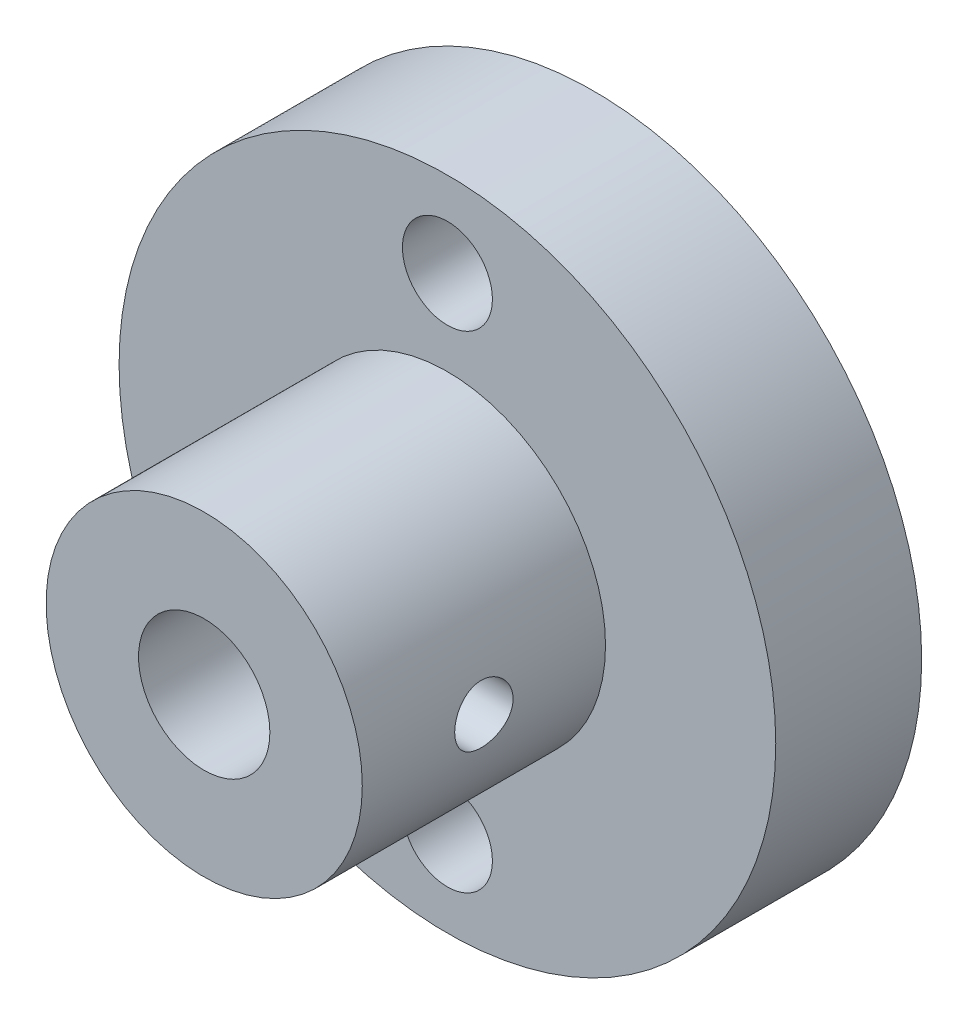
ISO-10303-21;
HEADER;
FILE_DESCRIPTION(('STEP AP214'),'2;1');
FILE_NAME('part.step','',(''),(''),'','','');
FILE_SCHEMA(('AUTOMOTIVE_DESIGN { 1 0 10303 214 1 1 1 1 }'));
ENDSEC;
DATA;
#1=APPLICATION_CONTEXT('core data for automotive mechanical design processes');
#2=APPLICATION_PROTOCOL_DEFINITION('international standard','automotive_design',2000,#1);
#3=PRODUCT_CONTEXT('',#1,'mechanical');
#4=PRODUCT('Part','Part','',(#3));
#5=PRODUCT_RELATED_PRODUCT_CATEGORY('part','',(#4));
#6=PRODUCT_DEFINITION_FORMATION('','',#4);
#7=PRODUCT_DEFINITION_CONTEXT('part definition',#1,'design');
#8=PRODUCT_DEFINITION('design','',#6,#7);
#9=PRODUCT_DEFINITION_SHAPE('','',#8);
#10=(LENGTH_UNIT() NAMED_UNIT(*) SI_UNIT(.MILLI.,.METRE.));
#11=(NAMED_UNIT(*) PLANE_ANGLE_UNIT() SI_UNIT($,.RADIAN.));
#12=(NAMED_UNIT(*) SI_UNIT($,.STERADIAN.) SOLID_ANGLE_UNIT());
#13=UNCERTAINTY_MEASURE_WITH_UNIT(LENGTH_MEASURE(1.E-05),#10,'distance_accuracy_value','');
#14=(GEOMETRIC_REPRESENTATION_CONTEXT(3) GLOBAL_UNCERTAINTY_ASSIGNED_CONTEXT((#13)) GLOBAL_UNIT_ASSIGNED_CONTEXT((#10,
#11,#12)) REPRESENTATION_CONTEXT('',''));
#15=CARTESIAN_POINT('',(0.,0.,0.));
#16=DIRECTION('',(0.,0.,1.));
#17=DIRECTION('',(1.,0.,0.));
#18=AXIS2_PLACEMENT_3D('',#15,#16,#17);
#19=CARTESIAN_POINT('',(25.,0.,11.));
#20=DIRECTION('',(-1.,0.,0.));
#21=DIRECTION('',(0.,0.,1.));
#22=AXIS2_PLACEMENT_3D('',#19,#20,#21);
#23=CYLINDRICAL_SURFACE('',#22,1.2);
#24=CARTESIAN_POINT('',(6.5,0.,12.2));
#25=CARTESIAN_POINT('',(6.49999879727572,-0.0667962993626081,12.1999974278829));
#26=CARTESIAN_POINT('',(6.49895972178335,-0.133626281673587,12.1944039721681));
#27=CARTESIAN_POINT('',(6.49491478174011,-0.265404300030401,12.172191600608));
#28=CARTESIAN_POINT('',(6.49190723570874,-0.330350677512255,12.1555632585209));
#29=CARTESIAN_POINT('',(6.48426191804226,-0.456436519782737,12.1118065638594));
#30=CARTESIAN_POINT('',(6.47962559903149,-0.517579319792999,12.0846875652248));
#31=CARTESIAN_POINT('',(6.46922952137734,-0.63444110969497,12.0207456276995));
#32=CARTESIAN_POINT('',(6.46346985907829,-0.690160564109868,11.9839235209079));
#33=CARTESIAN_POINT('',(6.45138834939994,-0.795247744205699,11.9011660344249));
#34=CARTESIAN_POINT('',(6.44506127279023,-0.844543292388614,11.8551397561373));
#35=CARTESIAN_POINT('',(6.43259702053078,-0.934759066401608,11.7554760006652));
#36=CARTESIAN_POINT('',(6.42645985829691,-0.975678701684754,11.7018379872634));
#37=CARTESIAN_POINT('',(6.41501951319584,-1.04827972317034,11.5879653111489));
#38=CARTESIAN_POINT('',(6.40972307507926,-1.07988798202191,11.5276832879546));
#39=CARTESIAN_POINT('',(6.40063738902812,-1.13250094978906,11.4025506689439));
#40=CARTESIAN_POINT('',(6.39684801526784,-1.15350654396689,11.3377004550609));
#41=CARTESIAN_POINT('',(6.39125806003697,-1.18408687284635,11.2060436035491));
#42=CARTESIAN_POINT('',(6.38943562620813,-1.19378730462821,11.1392671080334));
#43=CARTESIAN_POINT('',(6.38791998048299,-1.20187204389847,11.0050113933146));
#44=CARTESIAN_POINT('',(6.38822658354097,-1.20025733484479,10.9375322356926));
#45=CARTESIAN_POINT('',(6.39091446543458,-1.18585961873334,10.8046953870345));
#46=CARTESIAN_POINT('',(6.39326923845306,-1.17321929073711,10.7393216161376));
#47=CARTESIAN_POINT('',(6.39974652439446,-1.13735373323502,10.6116388619997));
#48=CARTESIAN_POINT('',(6.40386911035101,-1.11412806641468,10.5493300054981));
#49=CARTESIAN_POINT('',(6.41344535336497,-1.05761084900825,10.4291269281805));
#50=CARTESIAN_POINT('',(6.41890662438299,-1.0242614500129,10.3712605382117));
#51=CARTESIAN_POINT('',(6.43053982016241,-0.948484370023446,10.2618912881752));
#52=CARTESIAN_POINT('',(6.43671181488758,-0.906055794920213,10.2103890556326));
#53=CARTESIAN_POINT('',(6.44918666593044,-0.812554310960555,10.1143854911831));
#54=CARTESIAN_POINT('',(6.45549008145401,-0.761359307961523,10.0700030583735));
#55=CARTESIAN_POINT('',(6.46743086297198,-0.652187389345437,9.9904388129452));
#56=CARTESIAN_POINT('',(6.47306822266922,-0.594210409619175,9.95525708730987));
#57=CARTESIAN_POINT('',(6.48305257458405,-0.472998043002824,9.89507639819467));
#58=CARTESIAN_POINT('',(6.48739803241448,-0.409756516582691,9.87008953010376));
#59=CARTESIAN_POINT('',(6.49429705012122,-0.279875838888337,9.83112661435116));
#60=CARTESIAN_POINT('',(6.49685079444502,-0.213237038103507,9.8171494332818));
#61=CARTESIAN_POINT('',(6.49985338930874,-0.0794766430718829,9.80076752083491));
#62=CARTESIAN_POINT('',(6.50033187707818,-0.0123756497053712,9.79819983464421));
#63=CARTESIAN_POINT('',(6.49921181273706,0.121296981962713,9.8042730761626));
#64=CARTESIAN_POINT('',(6.49761335943468,0.187868645294989,9.8129134706596));
#65=CARTESIAN_POINT('',(6.49253745576473,0.318077984755796,9.84102211191283));
#66=CARTESIAN_POINT('',(6.48907427500552,0.381734009693139,9.86040816155233));
#67=CARTESIAN_POINT('',(6.4806556240529,0.504892375398316,9.9093690573418));
#68=CARTESIAN_POINT('',(6.47570005497306,0.564394440600633,9.93894457867032));
#69=CARTESIAN_POINT('',(6.4647724074758,0.678253095830679,10.0078073610227));
#70=CARTESIAN_POINT('',(6.45879008348503,0.732548265605505,10.0471945163265));
#71=CARTESIAN_POINT('',(6.44649953986676,0.833816870545852,10.1344270136108));
#72=CARTESIAN_POINT('',(6.44019129083715,0.880789643607566,10.1822731196305));
#73=CARTESIAN_POINT('',(6.42786191143313,0.966697085412809,10.2858021083737));
#74=CARTESIAN_POINT('',(6.42184551244879,1.00552070246097,10.3415777973493));
#75=CARTESIAN_POINT('',(6.41087523291019,1.07324774919417,10.4589549357169));
#76=CARTESIAN_POINT('',(6.40592131362856,1.10215154047974,10.5205561726499));
#77=CARTESIAN_POINT('',(6.39767379439307,1.14905975241548,10.6475497087302));
#78=CARTESIAN_POINT('',(6.39437235713613,1.16711570494917,10.7129224406376));
#79=CARTESIAN_POINT('',(6.38978543443045,1.19197513111159,10.8458401771607));
#80=CARTESIAN_POINT('',(6.38849972926177,1.19877983115992,10.9133849441999));
#81=CARTESIAN_POINT('',(6.3881007482456,1.20090353537778,11.0476175572827));
#82=CARTESIAN_POINT('',(6.38895435075601,1.19639765292492,11.1143025975303));
#83=CARTESIAN_POINT('',(6.39266448585662,1.17641079397786,11.2459474188607));
#84=CARTESIAN_POINT('',(6.39552100733921,1.16092987834811,11.310907209509));
#85=CARTESIAN_POINT('',(6.40290136886896,1.11950532017773,11.4371671962626));
#86=CARTESIAN_POINT('',(6.40742227523992,1.09358007946632,11.4984736122883));
#87=CARTESIAN_POINT('',(6.41762418955728,1.032021760182,11.6158947376739));
#88=CARTESIAN_POINT('',(6.42330527598439,0.996388024820644,11.6720090954421));
#89=CARTESIAN_POINT('',(6.43529057182139,0.915813071798076,11.7783315161889));
#90=CARTESIAN_POINT('',(6.44160263227606,0.870744203302652,11.8284419719686));
#91=CARTESIAN_POINT('',(6.45407937835197,0.772845002820405,11.9204475390134));
#92=CARTESIAN_POINT('',(6.46024402977463,0.720012889705214,11.9623407598269));
#93=CARTESIAN_POINT('',(6.47179409996219,0.607537484977904,12.0370617405115));
#94=CARTESIAN_POINT('',(6.47717228318667,0.547839004017674,12.0698075747291));
#95=CARTESIAN_POINT('',(6.48647285935735,0.42370854944922,12.124752828699));
#96=CARTESIAN_POINT('',(6.49039663100581,0.3592811283988,12.1469622420194));
#97=CARTESIAN_POINT('',(6.49553807584249,0.245545866371185,12.1756491928211));
#98=CARTESIAN_POINT('',(6.49720192234607,0.196906528350574,12.1847652844566));
#99=CARTESIAN_POINT('',(6.49943331626516,0.0988509306569767,12.1969415668264));
#100=CARTESIAN_POINT('',(6.50000089011371,0.0494346897454305,12.2000019035757));
#101=CARTESIAN_POINT('',(6.5,0.,12.2));
#102=B_SPLINE_CURVE_WITH_KNOTS('',3,(#24,#25,#26,#27,#28,#29,#30,#31,#32,#33,#34,#35,#36,#37,
#38,#39,#40,#41,#42,#43,#44,#45,#46,#47,#48,#49,#50,#51,#52,#53,#54,#55,#56,#57,#58,#59,#60,#61,
#62,#63,#64,#65,#66,#67,#68,#69,#70,#71,#72,#73,#74,#75,#76,#77,#78,#79,#80,#81,#82,#83,#84,#85,
#86,#87,#88,#89,#90,#91,#92,#93,#94,#95,#96,#97,#98,#99,#100,#101),.UNSPECIFIED.,.T.,.F.,(4,2,2,
2,2,2,2,2,2,2,2,2,2,2,2,2,2,2,2,2,2,2,2,2,2,2,2,2,2,2,2,2,2,2,2,2,2,2,4),(0.,0.200208125257265,
0.400587493204053,0.600788604213543,0.800972552376601,1.00324088953467,1.20552348279051,
1.40935476877731,1.61316903319364,1.81469487992138,2.01620321120369,2.21514193787252,
2.41408888408644,2.61419475105378,2.81432033334393,3.01750151628566,3.2206846200298,
3.42410808829514,3.6275106121083,3.8279985269071,4.02847690406412,4.22744250539259,
4.42642129319003,4.62751523490318,4.8286273493452,5.03232388047527,5.23601298560803,
5.43872666786995,5.64141825228765,5.84099112816951,6.04056289728494,6.23978456857919,
6.43901972074741,6.64114822168659,6.84332316977221,7.04725467103852,7.25099235904022,
7.39916621446434,7.54733649711547),.UNSPECIFIED.);
#103=CARTESIAN_POINT('',(6.5,0.,12.2));
#104=VERTEX_POINT('',#103);
#105=EDGE_CURVE('E83',#104,#104,#102,.T.);
#106=ORIENTED_EDGE('',*,*,#105,.T.);
#107=EDGE_LOOP('',(#106));
#108=FACE_BOUND('',#107,.T.);
#109=CARTESIAN_POINT('',(2.7,0.,12.2));
#110=CARTESIAN_POINT('',(2.69999413362057,0.0639065591023064,12.1999923831793));
#111=CARTESIAN_POINT('',(2.69770564197874,0.127893036523807,12.1948654918272));
#112=CARTESIAN_POINT('',(2.68877100210596,0.25403557600969,12.1745501771965));
#113=CARTESIAN_POINT('',(2.68211438349655,0.316186864128076,12.1593375776189));
#114=CARTESIAN_POINT('',(2.66515409854901,0.436621100359764,12.1195393890298));
#115=CARTESIAN_POINT('',(2.65486345340692,0.494916988807218,12.0949872409192));
#116=CARTESIAN_POINT('',(2.63161770990452,0.606498876298807,12.0373549198206));
#117=CARTESIAN_POINT('',(2.61866321902908,0.659786013548984,12.0042766907538));
#118=CARTESIAN_POINT('',(2.59055992340384,0.762887990999931,11.9285990703182));
#119=CARTESIAN_POINT('',(2.57533308413914,0.81238898179779,11.8856014072593));
#120=CARTESIAN_POINT('',(2.54471118380751,0.903753990005821,11.7921510489153));
#121=CARTESIAN_POINT('',(2.52931602821855,0.945613455081426,11.7416939419488));
#122=CARTESIAN_POINT('',(2.49909628261832,1.02290764342971,11.6312367647985));
#123=CARTESIAN_POINT('',(2.48435595827186,1.05783186961991,11.5708539108751));
#124=CARTESIAN_POINT('',(2.45837526696494,1.11688834822608,11.4443268523912));
#125=CARTESIAN_POINT('',(2.44713285796118,1.14102690079927,11.3781860382369));
#126=CARTESIAN_POINT('',(2.43027734905002,1.17648691470213,11.2456277716151));
#127=CARTESIAN_POINT('',(2.42439919523154,1.18841590189109,11.1794079593235));
#128=CARTESIAN_POINT('',(2.41818878362474,1.20100696979013,11.0456661379365));
#129=CARTESIAN_POINT('',(2.4178528219447,1.20167657524167,10.9781450287237));
#130=CARTESIAN_POINT('',(2.42254366026567,1.19218298581507,10.8501827308142));
#131=CARTESIAN_POINT('',(2.4270931542614,1.18298402341183,10.7896487784958));
#132=CARTESIAN_POINT('',(2.44022617227002,1.15564860756994,10.6710948650284));
#133=CARTESIAN_POINT('',(2.44881060282323,1.13751014562483,10.6130754720334));
#134=CARTESIAN_POINT('',(2.46924514284841,1.09245124275327,10.4996398233602));
#135=CARTESIAN_POINT('',(2.48116423077023,1.06534281441842,10.4443112329153));
#136=CARTESIAN_POINT('',(2.50691446994658,1.00324870493604,10.3387544513155));
#137=CARTESIAN_POINT('',(2.52074642529426,0.968259707202767,10.2885284205557));
#138=CARTESIAN_POINT('',(2.55039983349783,0.887404851023686,10.1894518391137));
#139=CARTESIAN_POINT('',(2.56628383219961,0.840811456550148,10.1412119129495));
#140=CARTESIAN_POINT('',(2.59712939767392,0.740062927274395,10.0530095338656));
#141=CARTESIAN_POINT('',(2.61209068461612,0.68590551463452,10.0130495834241));
#142=CARTESIAN_POINT('',(2.63995469383987,0.569491655107122,9.94147206336678));
#143=CARTESIAN_POINT('',(2.6527835515846,0.507043222559378,9.91013579408398));
#144=CARTESIAN_POINT('',(2.67435348404006,0.377044453719878,9.85863383005269));
#145=CARTESIAN_POINT('',(2.68309713525878,0.309497364424834,9.83846109306621));
#146=CARTESIAN_POINT('',(2.69500955063424,0.176292321296718,9.81121287038837));
#147=CARTESIAN_POINT('',(2.69852547661778,0.110832697825019,9.80331998164941));
#148=CARTESIAN_POINT('',(2.70072002319156,-0.020566223274589,9.7983781261587));
#149=CARTESIAN_POINT('',(2.69940028683998,-0.0865053503783305,9.80132547611901));
#150=CARTESIAN_POINT('',(2.69229177327389,-0.212944450043092,9.8174261436085));
#151=CARTESIAN_POINT('',(2.6867671065459,-0.273537850639587,9.8299765355117));
#152=CARTESIAN_POINT('',(2.67210325388452,-0.391675243775097,9.86405478746183));
#153=CARTESIAN_POINT('',(2.66296362867872,-0.449218864755503,9.88558373855752));
#154=CARTESIAN_POINT('',(2.64157426404399,-0.561662431159979,9.93769332944624));
#155=CARTESIAN_POINT('',(2.62923639136989,-0.616423892001831,9.96853540826862));
#156=CARTESIAN_POINT('',(2.60272873830794,-0.720191567250078,10.0381108556107));
#157=CARTESIAN_POINT('',(2.58855816108654,-0.769195260470478,10.0768476608872));
#158=CARTESIAN_POINT('',(2.5584767589195,-0.864220327521456,10.1647500678792));
#159=CARTESIAN_POINT('',(2.54251772459568,-0.909683032438224,10.2145045624883));
#160=CARTESIAN_POINT('',(2.51162480970985,-0.991801453598339,10.3211332041893));
#161=CARTESIAN_POINT('',(2.49669129392246,-1.02845404757698,10.3780098645164));
#162=CARTESIAN_POINT('',(2.46928674093927,-1.09264543882237,10.4990745846855));
#163=CARTESIAN_POINT('',(2.45688177642213,-1.11994996636762,10.5634029898212));
#164=CARTESIAN_POINT('',(2.4367650168031,-1.16307895210515,10.6964760891825));
#165=CARTESIAN_POINT('',(2.42904862954254,-1.1789146462074,10.7652163890263));
#166=CARTESIAN_POINT('',(2.41995032134622,-1.19747128693734,10.8988889457178));
#167=CARTESIAN_POINT('',(2.41808692940897,-1.20119006801553,10.9636501271561));
#168=CARTESIAN_POINT('',(2.41959773517966,-1.19814464927904,11.0928557618811));
#169=CARTESIAN_POINT('',(2.42297081605554,-1.19138268479251,11.157300279765));
#170=CARTESIAN_POINT('',(2.43410978875393,-1.16844135931616,11.2800151564985));
#171=CARTESIAN_POINT('',(2.44159919634577,-1.15285303217351,11.3384237119317));
#172=CARTESIAN_POINT('',(2.45987368091073,-1.11332516751525,11.4517891509191));
#173=CARTESIAN_POINT('',(2.4706597105559,-1.08938321564955,11.5067450311624));
#174=CARTESIAN_POINT('',(2.49516633461298,-1.03207265496533,11.6155025669727));
#175=CARTESIAN_POINT('',(2.50903068581858,-0.998198297609607,11.6690045975486));
#176=CARTESIAN_POINT('',(2.53778753442993,-0.922641583993335,11.7698748803223));
#177=CARTESIAN_POINT('',(2.55268045962436,-0.880955966494673,11.8172405565419));
#178=CARTESIAN_POINT('',(2.58337941872399,-0.78664877081698,11.9087734791821));
#179=CARTESIAN_POINT('',(2.59915136690634,-0.733389540278599,11.9522984992548));
#180=CARTESIAN_POINT('',(2.62855906078181,-0.619771086799431,12.0298610087285));
#181=CARTESIAN_POINT('',(2.64219382936338,-0.559408638242745,12.0638941639895));
#182=CARTESIAN_POINT('',(2.66567555365819,-0.433830067434941,12.1209347672237));
#183=CARTESIAN_POINT('',(2.67556359629795,-0.368676545242857,12.1440625356446));
#184=CARTESIAN_POINT('',(2.69059030099947,-0.234972811511182,12.178782185816));
#185=CARTESIAN_POINT('',(2.69574344748542,-0.166433639459938,12.1904092575191));
#186=CARTESIAN_POINT('',(2.69941490841779,-0.0650184194495728,12.1986821692355));
#187=CARTESIAN_POINT('',(2.70000298517181,-0.032519556731023,12.2000038759031));
#188=CARTESIAN_POINT('',(2.7,0.,12.2));
#189=B_SPLINE_CURVE_WITH_KNOTS('',3,(#109,#110,#111,#112,#113,#114,#115,#116,#117,#118,#119,
#120,#121,#122,#123,#124,#125,#126,#127,#128,#129,#130,#131,#132,#133,#134,#135,#136,#137,#138,
#139,#140,#141,#142,#143,#144,#145,#146,#147,#148,#149,#150,#151,#152,#153,#154,#155,#156,#157,
#158,#159,#160,#161,#162,#163,#164,#165,#166,#167,#168,#169,#170,#171,#172,#173,#174,#175,#176,
#177,#178,#179,#180,#181,#182,#183,#184,#185,#186,#187,#188),.UNSPECIFIED.,.T.,.F.,(4,2,2,2,2,2,
2,2,2,2,2,2,2,2,2,2,2,2,2,2,2,2,2,2,2,2,2,2,2,2,2,2,2,2,2,2,2,2,2,4),(0.,0.191618254692132,
0.383697503423909,0.57509537585916,0.766449648689667,0.96752346516017,1.16871668045946,
1.38152637924487,1.59421160802032,1.7957068529561,1.99706743153409,2.18040510018399,
2.36378397951647,2.55127911192394,2.73885330073873,2.94470008049905,3.15060898340504,
3.3626003754159,3.57445788501979,3.77149687786056,3.96846892713029,4.15399671722493,
4.33954705869644,4.53088617326196,4.72230876076459,4.92915910001196,5.13608263838593,
5.34786609388025,5.55944178537991,5.753084399156,5.94668571861527,6.12863978970841,
6.31064649247104,6.50431618226569,6.69806691096097,6.9087661101249,7.11956136104833,
7.32797307084532,7.53574508917101,7.63325214934906),.UNSPECIFIED.);
#190=CARTESIAN_POINT('',(2.7,0.,12.2));
#191=VERTEX_POINT('',#190);
#192=EDGE_CURVE('E56',#191,#191,#189,.T.);
#193=ORIENTED_EDGE('',*,*,#192,.T.);
#194=EDGE_LOOP('',(#193));
#195=FACE_BOUND('',#194,.T.);
#196=ADVANCED_FACE('F31',(#108,#195),#23,.F.);
#197=CARTESIAN_POINT('',(-6.5,0.,12.2));
#198=CARTESIAN_POINT('',(-6.49999879727572,0.0667962993626081,12.1999974278829));
#199=CARTESIAN_POINT('',(-6.49895972178335,0.133626281673587,12.1944039721681));
#200=CARTESIAN_POINT('',(-6.49491478174011,0.265404300030401,12.172191600608));
#201=CARTESIAN_POINT('',(-6.49190723570874,0.330350677512255,12.1555632585209));
#202=CARTESIAN_POINT('',(-6.48426191804226,0.456436519782737,12.1118065638594));
#203=CARTESIAN_POINT('',(-6.47962559903149,0.517579319792999,12.0846875652248));
#204=CARTESIAN_POINT('',(-6.46922952137734,0.63444110969497,12.0207456276995));
#205=CARTESIAN_POINT('',(-6.46346985907829,0.690160564109868,11.9839235209079));
#206=CARTESIAN_POINT('',(-6.45138834939994,0.795247744205699,11.9011660344249));
#207=CARTESIAN_POINT('',(-6.44506127279023,0.844543292388614,11.8551397561373));
#208=CARTESIAN_POINT('',(-6.43259702053078,0.934759066401608,11.7554760006652));
#209=CARTESIAN_POINT('',(-6.42645985829691,0.975678701684754,11.7018379872634));
#210=CARTESIAN_POINT('',(-6.41501951319584,1.04827972317034,11.5879653111489));
#211=CARTESIAN_POINT('',(-6.40972307507926,1.07988798202191,11.5276832879546));
#212=CARTESIAN_POINT('',(-6.40063738902812,1.13250094978906,11.4025506689439));
#213=CARTESIAN_POINT('',(-6.39684801526784,1.15350654396689,11.3377004550609));
#214=CARTESIAN_POINT('',(-6.39125806003697,1.18408687284635,11.2060436035491));
#215=CARTESIAN_POINT('',(-6.38943562620813,1.19378730462821,11.1392671080334));
#216=CARTESIAN_POINT('',(-6.38791998048299,1.20187204389847,11.0050113933146));
#217=CARTESIAN_POINT('',(-6.38822658354097,1.20025733484479,10.9375322356926));
#218=CARTESIAN_POINT('',(-6.39091446543458,1.18585961873334,10.8046953870345));
#219=CARTESIAN_POINT('',(-6.39326923845306,1.17321929073711,10.7393216161376));
#220=CARTESIAN_POINT('',(-6.39974652439446,1.13735373323502,10.6116388619997));
#221=CARTESIAN_POINT('',(-6.40386911035101,1.11412806641468,10.5493300054981));
#222=CARTESIAN_POINT('',(-6.41344535336497,1.05761084900825,10.4291269281805));
#223=CARTESIAN_POINT('',(-6.41890662438299,1.0242614500129,10.3712605382117));
#224=CARTESIAN_POINT('',(-6.43053982016241,0.948484370023446,10.2618912881752));
#225=CARTESIAN_POINT('',(-6.43671181488758,0.906055794920213,10.2103890556326));
#226=CARTESIAN_POINT('',(-6.44918666593044,0.812554310960555,10.1143854911831));
#227=CARTESIAN_POINT('',(-6.45549008145401,0.761359307961523,10.0700030583735));
#228=CARTESIAN_POINT('',(-6.46743086297198,0.652187389345437,9.9904388129452));
#229=CARTESIAN_POINT('',(-6.47306822266922,0.594210409619175,9.95525708730987));
#230=CARTESIAN_POINT('',(-6.48305257458405,0.472998043002824,9.89507639819467));
#231=CARTESIAN_POINT('',(-6.48739803241448,0.409756516582691,9.87008953010376));
#232=CARTESIAN_POINT('',(-6.49429705012122,0.279875838888337,9.83112661435116));
#233=CARTESIAN_POINT('',(-6.49685079444502,0.213237038103507,9.8171494332818));
#234=CARTESIAN_POINT('',(-6.49985338930874,0.0794766430718829,9.80076752083491));
#235=CARTESIAN_POINT('',(-6.50033187707818,0.0123756497053712,9.79819983464421));
#236=CARTESIAN_POINT('',(-6.49921181273706,-0.121296981962713,9.8042730761626));
#237=CARTESIAN_POINT('',(-6.49761335943468,-0.187868645294989,9.8129134706596));
#238=CARTESIAN_POINT('',(-6.49253745576473,-0.318077984755796,9.84102211191283));
#239=CARTESIAN_POINT('',(-6.48907427500552,-0.381734009693139,9.86040816155233));
#240=CARTESIAN_POINT('',(-6.4806556240529,-0.504892375398316,9.9093690573418));
#241=CARTESIAN_POINT('',(-6.47570005497306,-0.564394440600633,9.93894457867032));
#242=CARTESIAN_POINT('',(-6.4647724074758,-0.678253095830679,10.0078073610227));
#243=CARTESIAN_POINT('',(-6.45879008348503,-0.732548265605505,10.0471945163265));
#244=CARTESIAN_POINT('',(-6.44649953986676,-0.833816870545852,10.1344270136108));
#245=CARTESIAN_POINT('',(-6.44019129083715,-0.880789643607566,10.1822731196305));
#246=CARTESIAN_POINT('',(-6.42786191143313,-0.966697085412809,10.2858021083737));
#247=CARTESIAN_POINT('',(-6.42184551244879,-1.00552070246097,10.3415777973493));
#248=CARTESIAN_POINT('',(-6.41087523291019,-1.07324774919417,10.4589549357169));
#249=CARTESIAN_POINT('',(-6.40592131362856,-1.10215154047974,10.5205561726499));
#250=CARTESIAN_POINT('',(-6.39767379439307,-1.14905975241548,10.6475497087302));
#251=CARTESIAN_POINT('',(-6.39437235713613,-1.16711570494917,10.7129224406376));
#252=CARTESIAN_POINT('',(-6.38978543443045,-1.19197513111159,10.8458401771607));
#253=CARTESIAN_POINT('',(-6.38849972926177,-1.19877983115992,10.9133849441999));
#254=CARTESIAN_POINT('',(-6.3881007482456,-1.20090353537778,11.0476175572827));
#255=CARTESIAN_POINT('',(-6.38895435075601,-1.19639765292492,11.1143025975303));
#256=CARTESIAN_POINT('',(-6.39266448585662,-1.17641079397786,11.2459474188607));
#257=CARTESIAN_POINT('',(-6.39552100733921,-1.16092987834811,11.310907209509));
#258=CARTESIAN_POINT('',(-6.40290136886896,-1.11950532017773,11.4371671962626));
#259=CARTESIAN_POINT('',(-6.40742227523992,-1.09358007946632,11.4984736122883));
#260=CARTESIAN_POINT('',(-6.41762418955728,-1.032021760182,11.6158947376739));
#261=CARTESIAN_POINT('',(-6.42330527598439,-0.996388024820644,11.6720090954421));
#262=CARTESIAN_POINT('',(-6.43529057182139,-0.915813071798076,11.7783315161889));
#263=CARTESIAN_POINT('',(-6.44160263227606,-0.870744203302652,11.8284419719686));
#264=CARTESIAN_POINT('',(-6.45407937835197,-0.772845002820405,11.9204475390134));
#265=CARTESIAN_POINT('',(-6.46024402977463,-0.720012889705214,11.9623407598269));
#266=CARTESIAN_POINT('',(-6.47179409996219,-0.607537484977904,12.0370617405115));
#267=CARTESIAN_POINT('',(-6.47717228318667,-0.547839004017674,12.0698075747291));
#268=CARTESIAN_POINT('',(-6.48647285935735,-0.42370854944922,12.124752828699));
#269=CARTESIAN_POINT('',(-6.49039663100581,-0.3592811283988,12.1469622420194));
#270=CARTESIAN_POINT('',(-6.49553807584249,-0.245545866371185,12.1756491928211));
#271=CARTESIAN_POINT('',(-6.49720192234607,-0.196906528350574,12.1847652844566));
#272=CARTESIAN_POINT('',(-6.49943331626516,-0.0988509306569767,12.1969415668264));
#273=CARTESIAN_POINT('',(-6.50000089011371,-0.0494346897454305,12.2000019035757));
#274=CARTESIAN_POINT('',(-6.5,0.,12.2));
#275=B_SPLINE_CURVE_WITH_KNOTS('',3,(#197,#198,#199,#200,#201,#202,#203,#204,#205,#206,#207,
#208,#209,#210,#211,#212,#213,#214,#215,#216,#217,#218,#219,#220,#221,#222,#223,#224,#225,#226,
#227,#228,#229,#230,#231,#232,#233,#234,#235,#236,#237,#238,#239,#240,#241,#242,#243,#244,#245,
#246,#247,#248,#249,#250,#251,#252,#253,#254,#255,#256,#257,#258,#259,#260,#261,#262,#263,#264,
#265,#266,#267,#268,#269,#270,#271,#272,#273,#274),.UNSPECIFIED.,.T.,.F.,(4,2,2,2,2,2,2,2,2,2,2,
2,2,2,2,2,2,2,2,2,2,2,2,2,2,2,2,2,2,2,2,2,2,2,2,2,2,2,4),(0.,0.200208125257265,
0.400587493204053,0.600788604213543,0.800972552376601,1.00324088953467,1.20552348279051,
1.40935476877731,1.61316903319364,1.81469487992138,2.01620321120369,2.21514193787252,
2.41408888408644,2.61419475105378,2.81432033334393,3.01750151628566,3.2206846200298,
3.42410808829514,3.6275106121083,3.8279985269071,4.02847690406412,4.22744250539259,
4.42642129319003,4.62751523490318,4.8286273493452,5.03232388047527,5.23601298560803,
5.43872666786995,5.64141825228765,5.84099112816951,6.04056289728494,6.23978456857919,
6.43901972074741,6.64114822168659,6.84332316977221,7.04725467103852,7.25099235904022,
7.39916621446434,7.54733649711547),.UNSPECIFIED.);
#276=CARTESIAN_POINT('',(-6.5,0.,12.2));
#277=VERTEX_POINT('',#276);
#278=EDGE_CURVE('E89',#277,#277,#275,.T.);
#279=ORIENTED_EDGE('',*,*,#278,.T.);
#280=EDGE_LOOP('',(#279));
#281=FACE_BOUND('',#280,.T.);
#282=CARTESIAN_POINT('',(-2.7,0.,12.2));
#283=CARTESIAN_POINT('',(-2.69999413362057,-0.0639065591023064,12.1999923831793));
#284=CARTESIAN_POINT('',(-2.69770564197874,-0.127893036523807,12.1948654918272));
#285=CARTESIAN_POINT('',(-2.68877100210596,-0.25403557600969,12.1745501771965));
#286=CARTESIAN_POINT('',(-2.68211438349655,-0.316186864128076,12.1593375776189));
#287=CARTESIAN_POINT('',(-2.66515409854901,-0.436621100359764,12.1195393890298));
#288=CARTESIAN_POINT('',(-2.65486345340692,-0.494916988807218,12.0949872409192));
#289=CARTESIAN_POINT('',(-2.63161770990452,-0.606498876298807,12.0373549198206));
#290=CARTESIAN_POINT('',(-2.61866321902908,-0.659786013548984,12.0042766907538));
#291=CARTESIAN_POINT('',(-2.59055992340384,-0.762887990999931,11.9285990703182));
#292=CARTESIAN_POINT('',(-2.57533308413914,-0.81238898179779,11.8856014072593));
#293=CARTESIAN_POINT('',(-2.54471118380751,-0.903753990005821,11.7921510489153));
#294=CARTESIAN_POINT('',(-2.52931602821855,-0.945613455081426,11.7416939419488));
#295=CARTESIAN_POINT('',(-2.49909628261832,-1.02290764342971,11.6312367647985));
#296=CARTESIAN_POINT('',(-2.48435595827186,-1.05783186961991,11.5708539108751));
#297=CARTESIAN_POINT('',(-2.45837526696494,-1.11688834822608,11.4443268523912));
#298=CARTESIAN_POINT('',(-2.44713285796118,-1.14102690079927,11.3781860382369));
#299=CARTESIAN_POINT('',(-2.43027734905002,-1.17648691470213,11.2456277716151));
#300=CARTESIAN_POINT('',(-2.42439919523154,-1.18841590189109,11.1794079593235));
#301=CARTESIAN_POINT('',(-2.41818878362474,-1.20100696979013,11.0456661379365));
#302=CARTESIAN_POINT('',(-2.4178528219447,-1.20167657524167,10.9781450287237));
#303=CARTESIAN_POINT('',(-2.42254366026567,-1.19218298581507,10.8501827308142));
#304=CARTESIAN_POINT('',(-2.4270931542614,-1.18298402341183,10.7896487784958));
#305=CARTESIAN_POINT('',(-2.44022617227002,-1.15564860756994,10.6710948650284));
#306=CARTESIAN_POINT('',(-2.44881060282323,-1.13751014562483,10.6130754720334));
#307=CARTESIAN_POINT('',(-2.46924514284841,-1.09245124275327,10.4996398233602));
#308=CARTESIAN_POINT('',(-2.48116423077023,-1.06534281441842,10.4443112329153));
#309=CARTESIAN_POINT('',(-2.50691446994658,-1.00324870493604,10.3387544513155));
#310=CARTESIAN_POINT('',(-2.52074642529426,-0.968259707202767,10.2885284205557));
#311=CARTESIAN_POINT('',(-2.55039983349783,-0.887404851023686,10.1894518391137));
#312=CARTESIAN_POINT('',(-2.56628383219961,-0.840811456550148,10.1412119129495));
#313=CARTESIAN_POINT('',(-2.59712939767392,-0.740062927274395,10.0530095338656));
#314=CARTESIAN_POINT('',(-2.61209068461612,-0.68590551463452,10.0130495834241));
#315=CARTESIAN_POINT('',(-2.63995469383987,-0.569491655107122,9.94147206336678));
#316=CARTESIAN_POINT('',(-2.6527835515846,-0.507043222559378,9.91013579408398));
#317=CARTESIAN_POINT('',(-2.67435348404006,-0.377044453719878,9.85863383005269));
#318=CARTESIAN_POINT('',(-2.68309713525878,-0.309497364424834,9.83846109306621));
#319=CARTESIAN_POINT('',(-2.69500955063424,-0.176292321296718,9.81121287038837));
#320=CARTESIAN_POINT('',(-2.69852547661778,-0.110832697825019,9.80331998164941));
#321=CARTESIAN_POINT('',(-2.70072002319156,0.020566223274589,9.7983781261587));
#322=CARTESIAN_POINT('',(-2.69940028683998,0.0865053503783305,9.80132547611901));
#323=CARTESIAN_POINT('',(-2.69229177327389,0.212944450043092,9.8174261436085));
#324=CARTESIAN_POINT('',(-2.6867671065459,0.273537850639587,9.8299765355117));
#325=CARTESIAN_POINT('',(-2.67210325388452,0.391675243775097,9.86405478746183));
#326=CARTESIAN_POINT('',(-2.66296362867872,0.449218864755503,9.88558373855752));
#327=CARTESIAN_POINT('',(-2.64157426404399,0.561662431159979,9.93769332944624));
#328=CARTESIAN_POINT('',(-2.62923639136989,0.616423892001831,9.96853540826862));
#329=CARTESIAN_POINT('',(-2.60272873830794,0.720191567250078,10.0381108556107));
#330=CARTESIAN_POINT('',(-2.58855816108654,0.769195260470478,10.0768476608872));
#331=CARTESIAN_POINT('',(-2.5584767589195,0.864220327521456,10.1647500678792));
#332=CARTESIAN_POINT('',(-2.54251772459568,0.909683032438224,10.2145045624883));
#333=CARTESIAN_POINT('',(-2.51162480970985,0.991801453598339,10.3211332041893));
#334=CARTESIAN_POINT('',(-2.49669129392246,1.02845404757698,10.3780098645164));
#335=CARTESIAN_POINT('',(-2.46928674093927,1.09264543882237,10.4990745846855));
#336=CARTESIAN_POINT('',(-2.45688177642213,1.11994996636762,10.5634029898212));
#337=CARTESIAN_POINT('',(-2.4367650168031,1.16307895210515,10.6964760891825));
#338=CARTESIAN_POINT('',(-2.42904862954254,1.1789146462074,10.7652163890263));
#339=CARTESIAN_POINT('',(-2.41995032134622,1.19747128693734,10.8988889457178));
#340=CARTESIAN_POINT('',(-2.41808692940897,1.20119006801553,10.9636501271561));
#341=CARTESIAN_POINT('',(-2.41959773517966,1.19814464927904,11.0928557618811));
#342=CARTESIAN_POINT('',(-2.42297081605554,1.19138268479251,11.157300279765));
#343=CARTESIAN_POINT('',(-2.43410978875393,1.16844135931616,11.2800151564985));
#344=CARTESIAN_POINT('',(-2.44159919634577,1.15285303217351,11.3384237119317));
#345=CARTESIAN_POINT('',(-2.45987368091073,1.11332516751525,11.4517891509191));
#346=CARTESIAN_POINT('',(-2.4706597105559,1.08938321564955,11.5067450311624));
#347=CARTESIAN_POINT('',(-2.49516633461298,1.03207265496533,11.6155025669727));
#348=CARTESIAN_POINT('',(-2.50903068581858,0.998198297609607,11.6690045975486));
#349=CARTESIAN_POINT('',(-2.53778753442993,0.922641583993335,11.7698748803223));
#350=CARTESIAN_POINT('',(-2.55268045962436,0.880955966494673,11.8172405565419));
#351=CARTESIAN_POINT('',(-2.58337941872399,0.78664877081698,11.9087734791821));
#352=CARTESIAN_POINT('',(-2.59915136690634,0.733389540278599,11.9522984992548));
#353=CARTESIAN_POINT('',(-2.62855906078181,0.619771086799431,12.0298610087285));
#354=CARTESIAN_POINT('',(-2.64219382936338,0.559408638242745,12.0638941639895));
#355=CARTESIAN_POINT('',(-2.66567555365819,0.433830067434941,12.1209347672237));
#356=CARTESIAN_POINT('',(-2.67556359629795,0.368676545242857,12.1440625356446));
#357=CARTESIAN_POINT('',(-2.69059030099947,0.234972811511182,12.178782185816));
#358=CARTESIAN_POINT('',(-2.69574344748542,0.166433639459938,12.1904092575191));
#359=CARTESIAN_POINT('',(-2.69941490841779,0.0650184194495728,12.1986821692355));
#360=CARTESIAN_POINT('',(-2.70000298517181,0.032519556731023,12.2000038759031));
#361=CARTESIAN_POINT('',(-2.7,0.,12.2));
#362=B_SPLINE_CURVE_WITH_KNOTS('',3,(#282,#283,#284,#285,#286,#287,#288,#289,#290,#291,#292,
#293,#294,#295,#296,#297,#298,#299,#300,#301,#302,#303,#304,#305,#306,#307,#308,#309,#310,#311,
#312,#313,#314,#315,#316,#317,#318,#319,#320,#321,#322,#323,#324,#325,#326,#327,#328,#329,#330,
#331,#332,#333,#334,#335,#336,#337,#338,#339,#340,#341,#342,#343,#344,#345,#346,#347,#348,#349,
#350,#351,#352,#353,#354,#355,#356,#357,#358,#359,#360,#361),.UNSPECIFIED.,.T.,.F.,(4,2,2,2,2,2,
2,2,2,2,2,2,2,2,2,2,2,2,2,2,2,2,2,2,2,2,2,2,2,2,2,2,2,2,2,2,2,2,2,4),(0.,0.191618254692132,
0.383697503423909,0.57509537585916,0.766449648689667,0.96752346516017,1.16871668045946,
1.38152637924487,1.59421160802032,1.7957068529561,1.99706743153409,2.18040510018399,
2.36378397951647,2.55127911192394,2.73885330073873,2.94470008049905,3.15060898340504,
3.3626003754159,3.57445788501979,3.77149687786056,3.96846892713029,4.15399671722493,
4.33954705869644,4.53088617326196,4.72230876076459,4.92915910001196,5.13608263838593,
5.34786609388025,5.55944178537991,5.753084399156,5.94668571861527,6.12863978970841,
6.31064649247104,6.50431618226569,6.69806691096097,6.9087661101249,7.11956136104833,
7.32797307084532,7.53574508917101,7.63325214934906),.UNSPECIFIED.);
#363=CARTESIAN_POINT('',(-2.7,0.,12.2));
#364=VERTEX_POINT('',#363);
#365=EDGE_CURVE('E50',#364,#364,#362,.T.);
#366=ORIENTED_EDGE('',*,*,#365,.T.);
#367=EDGE_LOOP('',(#366));
#368=FACE_BOUND('',#367,.T.);
#369=ADVANCED_FACE('F96',(#281,#368),#23,.F.);
#370=CARTESIAN_POINT('',(0.,0.,16.));
#371=DIRECTION('',(0.,0.,-1.));
#372=DIRECTION('',(-1.,0.,0.));
#373=AXIS2_PLACEMENT_3D('',#370,#371,#372);
#374=CYLINDRICAL_SURFACE('',#373,6.5);
#375=CARTESIAN_POINT('',(0.,0.,16.));
#376=DIRECTION('',(0.,0.,1.));
#377=DIRECTION('',(1.,0.,0.));
#378=AXIS2_PLACEMENT_3D('',#375,#376,#377);
#379=CIRCLE('',#378,6.5);
#380=CARTESIAN_POINT('',(6.5,0.,16.));
#381=VERTEX_POINT('',#380);
#382=EDGE_CURVE('E44',#381,#381,#379,.T.);
#383=ORIENTED_EDGE('',*,*,#382,.F.);
#384=EDGE_LOOP('',(#383));
#385=FACE_BOUND('',#384,.T.);
#386=CARTESIAN_POINT('',(0.,0.,6.));
#387=DIRECTION('',(0.,0.,1.));
#388=DIRECTION('',(1.,0.,0.));
#389=AXIS2_PLACEMENT_3D('',#386,#387,#388);
#390=CIRCLE('',#389,6.5);
#391=CARTESIAN_POINT('',(6.5,0.,6.));
#392=VERTEX_POINT('',#391);
#393=EDGE_CURVE('E47',#392,#392,#390,.T.);
#394=ORIENTED_EDGE('',*,*,#393,.T.);
#395=EDGE_LOOP('',(#394));
#396=FACE_BOUND('',#395,.T.);
#397=ORIENTED_EDGE('',*,*,#105,.F.);
#398=EDGE_LOOP('',(#397));
#399=FACE_BOUND('',#398,.T.);
#400=ORIENTED_EDGE('',*,*,#278,.F.);
#401=EDGE_LOOP('',(#400));
#402=FACE_BOUND('',#401,.T.);
#403=ADVANCED_FACE('F92',(#385,#396,#399,#402),#374,.T.);
#404=CARTESIAN_POINT('',(0.,0.,6.));
#405=DIRECTION('',(0.,0.,-1.));
#406=DIRECTION('',(-1.,0.,0.));
#407=AXIS2_PLACEMENT_3D('',#404,#405,#406);
#408=CYLINDRICAL_SURFACE('',#407,13.5);
#409=CARTESIAN_POINT('',(0.,0.,6.));
#410=DIRECTION('',(0.,0.,1.));
#411=DIRECTION('',(1.,0.,0.));
#412=AXIS2_PLACEMENT_3D('',#409,#410,#411);
#413=CIRCLE('',#412,13.5);
#414=CARTESIAN_POINT('',(13.5,0.,6.));
#415=VERTEX_POINT('',#414);
#416=EDGE_CURVE('E10',#415,#415,#413,.T.);
#417=ORIENTED_EDGE('',*,*,#416,.F.);
#418=EDGE_LOOP('',(#417));
#419=FACE_BOUND('',#418,.T.);
#420=CARTESIAN_POINT('',(0.,0.,0.));
#421=DIRECTION('',(0.,0.,1.));
#422=DIRECTION('',(1.,0.,0.));
#423=AXIS2_PLACEMENT_3D('',#420,#421,#422);
#424=CIRCLE('',#423,13.5);
#425=CARTESIAN_POINT('',(13.5,0.,0.));
#426=VERTEX_POINT('',#425);
#427=EDGE_CURVE('E39',#426,#426,#424,.T.);
#428=ORIENTED_EDGE('',*,*,#427,.T.);
#429=EDGE_LOOP('',(#428));
#430=FACE_BOUND('',#429,.T.);
#431=ADVANCED_FACE('F33',(#419,#430),#408,.T.);
#432=CARTESIAN_POINT('',(0.,0.,6.));
#433=DIRECTION('',(0.,0.,1.));
#434=DIRECTION('',(1.,0.,0.));
#435=AXIS2_PLACEMENT_3D('',#432,#433,#434);
#436=PLANE('',#435);
#437=CARTESIAN_POINT('',(0.,-10.,6.));
#438=DIRECTION('',(0.,0.,-1.));
#439=DIRECTION('',(1.,0.,0.));
#440=AXIS2_PLACEMENT_3D('',#437,#438,#439);
#441=CIRCLE('',#440,1.85);
#442=CARTESIAN_POINT('',(1.85,-10.,6.));
#443=VERTEX_POINT('',#442);
#444=EDGE_CURVE('E196',#443,#443,#441,.T.);
#445=ORIENTED_EDGE('',*,*,#444,.T.);
#446=EDGE_LOOP('',(#445));
#447=FACE_BOUND('',#446,.T.);
#448=CARTESIAN_POINT('',(0.,10.,6.));
#449=DIRECTION('',(0.,0.,1.));
#450=DIRECTION('',(1.,0.,0.));
#451=AXIS2_PLACEMENT_3D('',#448,#449,#450);
#452=CIRCLE('',#451,1.85);
#453=CARTESIAN_POINT('',(1.85,10.,6.));
#454=VERTEX_POINT('',#453);
#455=EDGE_CURVE('E76',#454,#454,#452,.T.);
#456=ORIENTED_EDGE('',*,*,#455,.F.);
#457=EDGE_LOOP('',(#456));
#458=FACE_BOUND('',#457,.T.);
#459=ORIENTED_EDGE('',*,*,#393,.F.);
#460=EDGE_LOOP('',(#459));
#461=FACE_BOUND('',#460,.T.);
#462=ORIENTED_EDGE('',*,*,#416,.T.);
#463=EDGE_LOOP('',(#462));
#464=FACE_BOUND('',#463,.T.);
#465=ADVANCED_FACE('F98',(#447,#458,#461,#464),#436,.T.);
#466=CARTESIAN_POINT('',(0.,0.,0.));
#467=DIRECTION('',(0.,0.,1.));
#468=DIRECTION('',(1.,0.,0.));
#469=AXIS2_PLACEMENT_3D('',#466,#467,#468);
#470=PLANE('',#469);
#471=CARTESIAN_POINT('',(0.,-10.,0.));
#472=DIRECTION('',(0.,0.,1.));
#473=DIRECTION('',(1.,0.,0.));
#474=AXIS2_PLACEMENT_3D('',#471,#472,#473);
#475=CIRCLE('',#474,1.85);
#476=CARTESIAN_POINT('',(1.85,-10.,0.));
#477=VERTEX_POINT('',#476);
#478=EDGE_CURVE('E35',#477,#477,#475,.F.);
#479=ORIENTED_EDGE('',*,*,#478,.F.);
#480=EDGE_LOOP('',(#479));
#481=FACE_BOUND('',#480,.T.);
#482=CARTESIAN_POINT('',(0.,10.,0.));
#483=DIRECTION('',(0.,0.,1.));
#484=DIRECTION('',(1.,0.,0.));
#485=AXIS2_PLACEMENT_3D('',#482,#483,#484);
#486=CIRCLE('',#485,1.85);
#487=CARTESIAN_POINT('',(1.85,10.,0.));
#488=VERTEX_POINT('',#487);
#489=EDGE_CURVE('E57',#488,#488,#486,.T.);
#490=ORIENTED_EDGE('',*,*,#489,.T.);
#491=EDGE_LOOP('',(#490));
#492=FACE_BOUND('',#491,.T.);
#493=CARTESIAN_POINT('',(0.,0.,0.));
#494=DIRECTION('',(0.,0.,1.));
#495=DIRECTION('',(1.,0.,0.));
#496=AXIS2_PLACEMENT_3D('',#493,#494,#495);
#497=CIRCLE('',#496,2.7);
#498=CARTESIAN_POINT('',(2.7,0.,0.));
#499=VERTEX_POINT('',#498);
#500=EDGE_CURVE('E80',#499,#499,#497,.F.);
#501=ORIENTED_EDGE('',*,*,#500,.F.);
#502=EDGE_LOOP('',(#501));
#503=FACE_BOUND('',#502,.T.);
#504=ORIENTED_EDGE('',*,*,#427,.F.);
#505=EDGE_LOOP('',(#504));
#506=FACE_BOUND('',#505,.T.);
#507=ADVANCED_FACE('F101',(#481,#492,#503,#506),#470,.F.);
#508=CARTESIAN_POINT('',(0.,0.,16.));
#509=DIRECTION('',(0.,0.,1.));
#510=DIRECTION('',(1.,0.,0.));
#511=AXIS2_PLACEMENT_3D('',#508,#509,#510);
#512=PLANE('',#511);
#513=CARTESIAN_POINT('',(0.,0.,16.));
#514=DIRECTION('',(0.,0.,1.));
#515=DIRECTION('',(1.,0.,0.));
#516=AXIS2_PLACEMENT_3D('',#513,#514,#515);
#517=CIRCLE('',#516,2.7);
#518=CARTESIAN_POINT('',(2.7,0.,16.));
#519=VERTEX_POINT('',#518);
#520=EDGE_CURVE('E75',#519,#519,#517,.F.);
#521=ORIENTED_EDGE('',*,*,#520,.T.);
#522=EDGE_LOOP('',(#521));
#523=FACE_BOUND('',#522,.T.);
#524=ORIENTED_EDGE('',*,*,#382,.T.);
#525=EDGE_LOOP('',(#524));
#526=FACE_BOUND('',#525,.T.);
#527=ADVANCED_FACE('F65',(#523,#526),#512,.T.);
#528=CARTESIAN_POINT('',(0.,0.,56.));
#529=DIRECTION('',(0.,0.,-1.));
#530=DIRECTION('',(-1.,0.,0.));
#531=AXIS2_PLACEMENT_3D('',#528,#529,#530);
#532=CYLINDRICAL_SURFACE('',#531,2.7);
#533=ORIENTED_EDGE('',*,*,#365,.F.);
#534=EDGE_LOOP('',(#533));
#535=FACE_BOUND('',#534,.T.);
#536=ORIENTED_EDGE('',*,*,#192,.F.);
#537=EDGE_LOOP('',(#536));
#538=FACE_BOUND('',#537,.T.);
#539=ORIENTED_EDGE('',*,*,#520,.F.);
#540=EDGE_LOOP('',(#539));
#541=FACE_BOUND('',#540,.T.);
#542=ORIENTED_EDGE('',*,*,#500,.T.);
#543=EDGE_LOOP('',(#542));
#544=FACE_BOUND('',#543,.T.);
#545=ADVANCED_FACE('F60',(#535,#538,#541,#544),#532,.F.);
#546=CARTESIAN_POINT('',(0.,10.,-4.));
#547=DIRECTION('',(0.,0.,1.));
#548=DIRECTION('',(1.,0.,0.));
#549=AXIS2_PLACEMENT_3D('',#546,#547,#548);
#550=CYLINDRICAL_SURFACE('',#549,1.85);
#551=ORIENTED_EDGE('',*,*,#455,.T.);
#552=EDGE_LOOP('',(#551));
#553=FACE_BOUND('',#552,.T.);
#554=ORIENTED_EDGE('',*,*,#489,.F.);
#555=EDGE_LOOP('',(#554));
#556=FACE_BOUND('',#555,.T.);
#557=ADVANCED_FACE('F64',(#553,#556),#550,.F.);
#558=CARTESIAN_POINT('',(0.,-10.,-4.));
#559=DIRECTION('',(0.,0.,1.));
#560=DIRECTION('',(1.,0.,0.));
#561=AXIS2_PLACEMENT_3D('',#558,#559,#560);
#562=CYLINDRICAL_SURFACE('',#561,1.85);
#563=ORIENTED_EDGE('',*,*,#444,.F.);
#564=EDGE_LOOP('',(#563));
#565=FACE_BOUND('',#564,.T.);
#566=ORIENTED_EDGE('',*,*,#478,.T.);
#567=EDGE_LOOP('',(#566));
#568=FACE_BOUND('',#567,.T.);
#569=ADVANCED_FACE('F154',(#565,#568),#562,.F.);
#570=CLOSED_SHELL('',(#196,#369,#403,#431,#465,#507,#527,#545,#557,#569));
#571=MANIFOLD_SOLID_BREP('B2',#570);
#572=ADVANCED_BREP_SHAPE_REPRESENTATION('',(#18,#571),#14);
#573=SHAPE_DEFINITION_REPRESENTATION(#9,#572);
ENDSEC;
END-ISO-10303-21;
